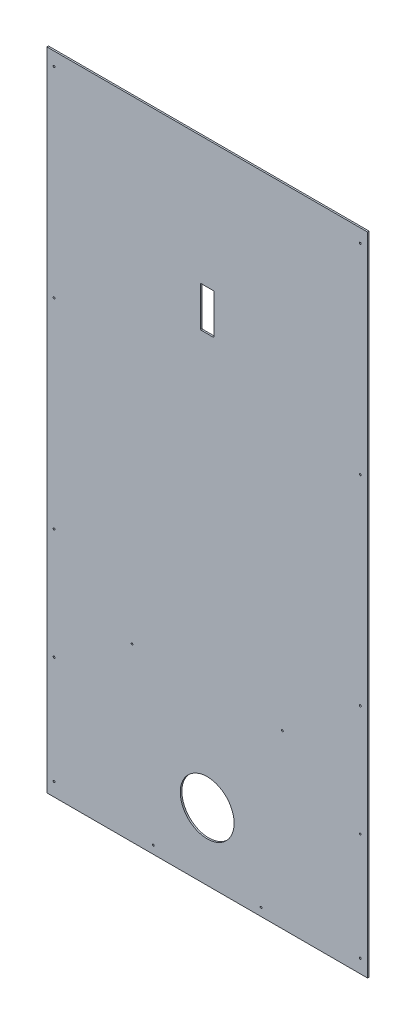
ISO-10303-21;
HEADER;
FILE_DESCRIPTION(('STEP AP214'),'2;1');
FILE_NAME('part.step','',(''),(''),'','','');
FILE_SCHEMA(('AUTOMOTIVE_DESIGN { 1 0 10303 214 1 1 1 1 }'));
ENDSEC;
DATA;
#1=APPLICATION_CONTEXT('core data for automotive mechanical design processes');
#2=APPLICATION_PROTOCOL_DEFINITION('international standard','automotive_design',2000,#1);
#3=PRODUCT_CONTEXT('',#1,'mechanical');
#4=PRODUCT('Part','Part','',(#3));
#5=PRODUCT_RELATED_PRODUCT_CATEGORY('part','',(#4));
#6=PRODUCT_DEFINITION_FORMATION('','',#4);
#7=PRODUCT_DEFINITION_CONTEXT('part definition',#1,'design');
#8=PRODUCT_DEFINITION('design','',#6,#7);
#9=PRODUCT_DEFINITION_SHAPE('','',#8);
#10=(LENGTH_UNIT() NAMED_UNIT(*) SI_UNIT(.MILLI.,.METRE.));
#11=(NAMED_UNIT(*) PLANE_ANGLE_UNIT() SI_UNIT($,.RADIAN.));
#12=(NAMED_UNIT(*) SI_UNIT($,.STERADIAN.) SOLID_ANGLE_UNIT());
#13=UNCERTAINTY_MEASURE_WITH_UNIT(LENGTH_MEASURE(1.E-05),#10,'distance_accuracy_value','');
#14=(GEOMETRIC_REPRESENTATION_CONTEXT(3) GLOBAL_UNCERTAINTY_ASSIGNED_CONTEXT((#13)) GLOBAL_UNIT_ASSIGNED_CONTEXT((#10,
#11,#12)) REPRESENTATION_CONTEXT('',''));
#15=CARTESIAN_POINT('',(0.,0.,0.));
#16=DIRECTION('',(0.,0.,1.));
#17=DIRECTION('',(1.,0.,0.));
#18=AXIS2_PLACEMENT_3D('',#15,#16,#17);
#19=CARTESIAN_POINT('',(-302.41875,609.6,2.9972));
#20=DIRECTION('',(0.,-1.,0.));
#21=DIRECTION('',(0.,0.,-1.));
#22=AXIS2_PLACEMENT_3D('',#19,#20,#21);
#23=PLANE('',#22);
#24=DIRECTION('',(0.,0.,-1.));
#25=VECTOR('',#24,1.);
#26=CARTESIAN_POINT('',(302.41875,609.6,1.4986));
#27=LINE('',#26,#25);
#28=CARTESIAN_POINT('',(302.41875,609.6,2.9972));
#29=VERTEX_POINT('',#28);
#30=CARTESIAN_POINT('',(302.41875,609.6,0.));
#31=VERTEX_POINT('',#30);
#32=EDGE_CURVE('E132',#29,#31,#27,.T.);
#33=ORIENTED_EDGE('',*,*,#32,.T.);
#34=DIRECTION('',(-1.,0.,0.));
#35=VECTOR('',#34,1.);
#36=CARTESIAN_POINT('',(0.,609.6,0.));
#37=LINE('',#36,#35);
#38=CARTESIAN_POINT('',(-302.41875,609.6,0.));
#39=VERTEX_POINT('',#38);
#40=EDGE_CURVE('E126',#31,#39,#37,.T.);
#41=ORIENTED_EDGE('',*,*,#40,.T.);
#42=DIRECTION('',(0.,0.,1.));
#43=VECTOR('',#42,1.);
#44=CARTESIAN_POINT('',(-302.41875,609.6,1.4986));
#45=LINE('',#44,#43);
#46=CARTESIAN_POINT('',(-302.41875,609.6,2.9972));
#47=VERTEX_POINT('',#46);
#48=EDGE_CURVE('E111',#39,#47,#45,.T.);
#49=ORIENTED_EDGE('',*,*,#48,.T.);
#50=DIRECTION('',(-1.,0.,0.));
#51=VECTOR('',#50,1.);
#52=CARTESIAN_POINT('',(0.,609.6,2.9972));
#53=LINE('',#52,#51);
#54=EDGE_CURVE('E216',#29,#47,#53,.T.);
#55=ORIENTED_EDGE('',*,*,#54,.F.);
#56=EDGE_LOOP('',(#33,#41,#49,#55));
#57=FACE_BOUND('',#56,.T.);
#58=ADVANCED_FACE('F17',(#57),#23,.F.);
#59=CARTESIAN_POINT('',(-302.41875,-609.6,2.9972));
#60=DIRECTION('',(1.,0.,0.));
#61=DIRECTION('',(0.,0.,-1.));
#62=AXIS2_PLACEMENT_3D('',#59,#60,#61);
#63=PLANE('',#62);
#64=ORIENTED_EDGE('',*,*,#48,.F.);
#65=DIRECTION('',(0.,-1.,0.));
#66=VECTOR('',#65,1.);
#67=CARTESIAN_POINT('',(-302.41875,0.,0.));
#68=LINE('',#67,#66);
#69=CARTESIAN_POINT('',(-302.41875,-609.6,0.));
#70=VERTEX_POINT('',#69);
#71=EDGE_CURVE('E115',#39,#70,#68,.T.);
#72=ORIENTED_EDGE('',*,*,#71,.T.);
#73=DIRECTION('',(0.,0.,1.));
#74=VECTOR('',#73,1.);
#75=CARTESIAN_POINT('',(-302.41875,-609.6,1.4986));
#76=LINE('',#75,#74);
#77=CARTESIAN_POINT('',(-302.41875,-609.6,2.9972));
#78=VERTEX_POINT('',#77);
#79=EDGE_CURVE('E121',#70,#78,#76,.T.);
#80=ORIENTED_EDGE('',*,*,#79,.T.);
#81=DIRECTION('',(0.,-1.,0.));
#82=VECTOR('',#81,1.);
#83=CARTESIAN_POINT('',(-302.41875,0.,2.9972));
#84=LINE('',#83,#82);
#85=EDGE_CURVE('E117',#47,#78,#84,.T.);
#86=ORIENTED_EDGE('',*,*,#85,.F.);
#87=EDGE_LOOP('',(#64,#72,#80,#86));
#88=FACE_BOUND('',#87,.T.);
#89=ADVANCED_FACE('F113',(#88),#63,.F.);
#90=CARTESIAN_POINT('',(-302.41875,-609.6,0.));
#91=DIRECTION('',(0.,1.,0.));
#92=DIRECTION('',(0.,0.,1.));
#93=AXIS2_PLACEMENT_3D('',#90,#91,#92);
#94=PLANE('',#93);
#95=ORIENTED_EDGE('',*,*,#79,.F.);
#96=DIRECTION('',(1.,0.,0.));
#97=VECTOR('',#96,1.);
#98=CARTESIAN_POINT('',(0.,-609.6,0.));
#99=LINE('',#98,#97);
#100=CARTESIAN_POINT('',(302.41875,-609.6,0.));
#101=VERTEX_POINT('',#100);
#102=EDGE_CURVE('E129',#70,#101,#99,.T.);
#103=ORIENTED_EDGE('',*,*,#102,.T.);
#104=DIRECTION('',(0.,0.,1.));
#105=VECTOR('',#104,1.);
#106=CARTESIAN_POINT('',(302.41875,-609.6,1.4986));
#107=LINE('',#106,#105);
#108=CARTESIAN_POINT('',(302.41875,-609.6,2.9972));
#109=VERTEX_POINT('',#108);
#110=EDGE_CURVE('E95',#101,#109,#107,.T.);
#111=ORIENTED_EDGE('',*,*,#110,.T.);
#112=DIRECTION('',(1.,0.,0.));
#113=VECTOR('',#112,1.);
#114=CARTESIAN_POINT('',(0.,-609.6,2.9972));
#115=LINE('',#114,#113);
#116=EDGE_CURVE('E285',#78,#109,#115,.T.);
#117=ORIENTED_EDGE('',*,*,#116,.F.);
#118=EDGE_LOOP('',(#95,#103,#111,#117));
#119=FACE_BOUND('',#118,.T.);
#120=ADVANCED_FACE('F423',(#119),#94,.F.);
#121=CARTESIAN_POINT('',(302.41875,-609.6,0.));
#122=DIRECTION('',(-1.,0.,0.));
#123=DIRECTION('',(0.,0.,1.));
#124=AXIS2_PLACEMENT_3D('',#121,#122,#123);
#125=PLANE('',#124);
#126=ORIENTED_EDGE('',*,*,#110,.F.);
#127=DIRECTION('',(0.,1.,0.));
#128=VECTOR('',#127,1.);
#129=CARTESIAN_POINT('',(302.41875,0.,0.));
#130=LINE('',#129,#128);
#131=EDGE_CURVE('E269',#101,#31,#130,.T.);
#132=ORIENTED_EDGE('',*,*,#131,.T.);
#133=ORIENTED_EDGE('',*,*,#32,.F.);
#134=DIRECTION('',(0.,1.,0.));
#135=VECTOR('',#134,1.);
#136=CARTESIAN_POINT('',(302.41875,0.,2.9972));
#137=LINE('',#136,#135);
#138=EDGE_CURVE('E212',#109,#29,#137,.T.);
#139=ORIENTED_EDGE('',*,*,#138,.F.);
#140=EDGE_LOOP('',(#126,#132,#133,#139));
#141=FACE_BOUND('',#140,.T.);
#142=ADVANCED_FACE('F418',(#141),#125,.F.);
#143=CARTESIAN_POINT('',(288.925,-171.45,0.));
#144=DIRECTION('',(0.,0.,1.));
#145=DIRECTION('',(1.,0.,0.));
#146=AXIS2_PLACEMENT_3D('',#143,#144,#145);
#147=CYLINDRICAL_SURFACE('',#146,1.778);
#148=CARTESIAN_POINT('',(288.925,-171.45,0.));
#149=DIRECTION('',(0.,0.,1.));
#150=DIRECTION('',(1.,0.,0.));
#151=AXIS2_PLACEMENT_3D('',#148,#149,#150);
#152=CIRCLE('',#151,1.778);
#153=CARTESIAN_POINT('',(290.703,-171.45,0.));
#154=VERTEX_POINT('',#153);
#155=EDGE_CURVE('E21',#154,#154,#152,.F.);
#156=ORIENTED_EDGE('',*,*,#155,.T.);
#157=EDGE_LOOP('',(#156));
#158=FACE_BOUND('',#157,.T.);
#159=CARTESIAN_POINT('',(288.925,-171.45,2.9972));
#160=DIRECTION('',(0.,0.,1.));
#161=DIRECTION('',(1.,0.,0.));
#162=AXIS2_PLACEMENT_3D('',#159,#160,#161);
#163=CIRCLE('',#162,1.778);
#164=CARTESIAN_POINT('',(290.703,-171.45,2.9972));
#165=VERTEX_POINT('',#164);
#166=EDGE_CURVE('E209',#165,#165,#163,.F.);
#167=ORIENTED_EDGE('',*,*,#166,.F.);
#168=EDGE_LOOP('',(#167));
#169=FACE_BOUND('',#168,.T.);
#170=ADVANCED_FACE('F415',(#158,#169),#147,.F.);
#171=CARTESIAN_POINT('',(288.925,584.2,0.));
#172=DIRECTION('',(0.,0.,1.));
#173=DIRECTION('',(1.,0.,0.));
#174=AXIS2_PLACEMENT_3D('',#171,#172,#173);
#175=CYLINDRICAL_SURFACE('',#174,1.778);
#176=CARTESIAN_POINT('',(288.925,584.2,0.));
#177=DIRECTION('',(0.,0.,1.));
#178=DIRECTION('',(1.,0.,0.));
#179=AXIS2_PLACEMENT_3D('',#176,#177,#178);
#180=CIRCLE('',#179,1.778);
#181=CARTESIAN_POINT('',(290.703,584.2,0.));
#182=VERTEX_POINT('',#181);
#183=EDGE_CURVE('E264',#182,#182,#180,.F.);
#184=ORIENTED_EDGE('',*,*,#183,.T.);
#185=EDGE_LOOP('',(#184));
#186=FACE_BOUND('',#185,.T.);
#187=CARTESIAN_POINT('',(288.925,584.2,2.9972));
#188=DIRECTION('',(0.,0.,1.));
#189=DIRECTION('',(1.,0.,0.));
#190=AXIS2_PLACEMENT_3D('',#187,#188,#189);
#191=CIRCLE('',#190,1.778);
#192=CARTESIAN_POINT('',(290.703,584.2,2.9972));
#193=VERTEX_POINT('',#192);
#194=EDGE_CURVE('E206',#193,#193,#191,.F.);
#195=ORIENTED_EDGE('',*,*,#194,.F.);
#196=EDGE_LOOP('',(#195));
#197=FACE_BOUND('',#196,.T.);
#198=ADVANCED_FACE('F411',(#186,#197),#175,.F.);
#199=CARTESIAN_POINT('',(-288.925,-584.2,0.));
#200=DIRECTION('',(0.,0.,1.));
#201=DIRECTION('',(1.,0.,0.));
#202=AXIS2_PLACEMENT_3D('',#199,#200,#201);
#203=CYLINDRICAL_SURFACE('',#202,1.77799999999995);
#204=CARTESIAN_POINT('',(-288.925,-584.2,0.));
#205=DIRECTION('',(0.,0.,1.));
#206=DIRECTION('',(1.,0.,0.));
#207=AXIS2_PLACEMENT_3D('',#204,#205,#206);
#208=CIRCLE('',#207,1.77799999999995);
#209=CARTESIAN_POINT('',(-287.147,-584.2,0.));
#210=VERTEX_POINT('',#209);
#211=EDGE_CURVE('E262',#210,#210,#208,.F.);
#212=ORIENTED_EDGE('',*,*,#211,.T.);
#213=EDGE_LOOP('',(#212));
#214=FACE_BOUND('',#213,.T.);
#215=CARTESIAN_POINT('',(-288.925,-584.2,2.9972));
#216=DIRECTION('',(0.,0.,1.));
#217=DIRECTION('',(1.,0.,0.));
#218=AXIS2_PLACEMENT_3D('',#215,#216,#217);
#219=CIRCLE('',#218,1.77799999999995);
#220=CARTESIAN_POINT('',(-287.147,-584.2,2.9972));
#221=VERTEX_POINT('',#220);
#222=EDGE_CURVE('E203',#221,#221,#219,.F.);
#223=ORIENTED_EDGE('',*,*,#222,.F.);
#224=EDGE_LOOP('',(#223));
#225=FACE_BOUND('',#224,.T.);
#226=ADVANCED_FACE('F407',(#214,#225),#203,.F.);
#227=CARTESIAN_POINT('',(-288.925,-381.,0.));
#228=DIRECTION('',(0.,0.,1.));
#229=DIRECTION('',(1.,0.,0.));
#230=AXIS2_PLACEMENT_3D('',#227,#228,#229);
#231=CYLINDRICAL_SURFACE('',#230,1.77799999999995);
#232=CARTESIAN_POINT('',(-288.925,-381.,0.));
#233=DIRECTION('',(0.,0.,1.));
#234=DIRECTION('',(1.,0.,0.));
#235=AXIS2_PLACEMENT_3D('',#232,#233,#234);
#236=CIRCLE('',#235,1.77799999999995);
#237=CARTESIAN_POINT('',(-287.147,-381.,0.));
#238=VERTEX_POINT('',#237);
#239=EDGE_CURVE('E259',#238,#238,#236,.F.);
#240=ORIENTED_EDGE('',*,*,#239,.T.);
#241=EDGE_LOOP('',(#240));
#242=FACE_BOUND('',#241,.T.);
#243=CARTESIAN_POINT('',(-288.925,-381.,2.9972));
#244=DIRECTION('',(0.,0.,1.));
#245=DIRECTION('',(1.,0.,0.));
#246=AXIS2_PLACEMENT_3D('',#243,#244,#245);
#247=CIRCLE('',#246,1.77799999999995);
#248=CARTESIAN_POINT('',(-287.147,-381.,2.9972));
#249=VERTEX_POINT('',#248);
#250=EDGE_CURVE('E200',#249,#249,#247,.F.);
#251=ORIENTED_EDGE('',*,*,#250,.F.);
#252=EDGE_LOOP('',(#251));
#253=FACE_BOUND('',#252,.T.);
#254=ADVANCED_FACE('F403',(#242,#253),#231,.F.);
#255=CARTESIAN_POINT('',(-288.925,-171.45,0.));
#256=DIRECTION('',(0.,0.,1.));
#257=DIRECTION('',(1.,0.,0.));
#258=AXIS2_PLACEMENT_3D('',#255,#256,#257);
#259=CYLINDRICAL_SURFACE('',#258,1.77799999999995);
#260=CARTESIAN_POINT('',(-288.925,-171.45,0.));
#261=DIRECTION('',(0.,0.,1.));
#262=DIRECTION('',(1.,0.,0.));
#263=AXIS2_PLACEMENT_3D('',#260,#261,#262);
#264=CIRCLE('',#263,1.77799999999995);
#265=CARTESIAN_POINT('',(-287.147,-171.45,0.));
#266=VERTEX_POINT('',#265);
#267=EDGE_CURVE('E256',#266,#266,#264,.F.);
#268=ORIENTED_EDGE('',*,*,#267,.T.);
#269=EDGE_LOOP('',(#268));
#270=FACE_BOUND('',#269,.T.);
#271=CARTESIAN_POINT('',(-288.925,-171.45,2.9972));
#272=DIRECTION('',(0.,0.,1.));
#273=DIRECTION('',(1.,0.,0.));
#274=AXIS2_PLACEMENT_3D('',#271,#272,#273);
#275=CIRCLE('',#274,1.77799999999995);
#276=CARTESIAN_POINT('',(-287.147,-171.45,2.9972));
#277=VERTEX_POINT('',#276);
#278=EDGE_CURVE('E197',#277,#277,#275,.F.);
#279=ORIENTED_EDGE('',*,*,#278,.F.);
#280=EDGE_LOOP('',(#279));
#281=FACE_BOUND('',#280,.T.);
#282=ADVANCED_FACE('F399',(#270,#281),#259,.F.);
#283=CARTESIAN_POINT('',(-288.925,206.375,0.));
#284=DIRECTION('',(0.,0.,1.));
#285=DIRECTION('',(1.,0.,0.));
#286=AXIS2_PLACEMENT_3D('',#283,#284,#285);
#287=CYLINDRICAL_SURFACE('',#286,1.77799999999995);
#288=CARTESIAN_POINT('',(-288.925,206.375,0.));
#289=DIRECTION('',(0.,0.,1.));
#290=DIRECTION('',(1.,0.,0.));
#291=AXIS2_PLACEMENT_3D('',#288,#289,#290);
#292=CIRCLE('',#291,1.77799999999995);
#293=CARTESIAN_POINT('',(-287.147,206.375,0.));
#294=VERTEX_POINT('',#293);
#295=EDGE_CURVE('E253',#294,#294,#292,.F.);
#296=ORIENTED_EDGE('',*,*,#295,.T.);
#297=EDGE_LOOP('',(#296));
#298=FACE_BOUND('',#297,.T.);
#299=CARTESIAN_POINT('',(-288.925,206.375,2.9972));
#300=DIRECTION('',(0.,0.,1.));
#301=DIRECTION('',(1.,0.,0.));
#302=AXIS2_PLACEMENT_3D('',#299,#300,#301);
#303=CIRCLE('',#302,1.77799999999995);
#304=CARTESIAN_POINT('',(-287.147,206.375,2.9972));
#305=VERTEX_POINT('',#304);
#306=EDGE_CURVE('E194',#305,#305,#303,.F.);
#307=ORIENTED_EDGE('',*,*,#306,.F.);
#308=EDGE_LOOP('',(#307));
#309=FACE_BOUND('',#308,.T.);
#310=ADVANCED_FACE('F395',(#298,#309),#287,.F.);
#311=CARTESIAN_POINT('',(-288.925,584.2,0.));
#312=DIRECTION('',(0.,0.,1.));
#313=DIRECTION('',(1.,0.,0.));
#314=AXIS2_PLACEMENT_3D('',#311,#312,#313);
#315=CYLINDRICAL_SURFACE('',#314,1.77799999999995);
#316=CARTESIAN_POINT('',(-288.925,584.2,0.));
#317=DIRECTION('',(0.,0.,1.));
#318=DIRECTION('',(1.,0.,0.));
#319=AXIS2_PLACEMENT_3D('',#316,#317,#318);
#320=CIRCLE('',#319,1.77799999999995);
#321=CARTESIAN_POINT('',(-287.147,584.2,0.));
#322=VERTEX_POINT('',#321);
#323=EDGE_CURVE('E250',#322,#322,#320,.F.);
#324=ORIENTED_EDGE('',*,*,#323,.T.);
#325=EDGE_LOOP('',(#324));
#326=FACE_BOUND('',#325,.T.);
#327=CARTESIAN_POINT('',(-288.925,584.2,2.9972));
#328=DIRECTION('',(0.,0.,1.));
#329=DIRECTION('',(1.,0.,0.));
#330=AXIS2_PLACEMENT_3D('',#327,#328,#329);
#331=CIRCLE('',#330,1.77799999999995);
#332=CARTESIAN_POINT('',(-287.147,584.2,2.9972));
#333=VERTEX_POINT('',#332);
#334=EDGE_CURVE('E191',#333,#333,#331,.F.);
#335=ORIENTED_EDGE('',*,*,#334,.F.);
#336=EDGE_LOOP('',(#335));
#337=FACE_BOUND('',#336,.T.);
#338=ADVANCED_FACE('F391',(#326,#337),#315,.F.);
#339=CARTESIAN_POINT('',(288.925,206.375,0.));
#340=DIRECTION('',(0.,0.,1.));
#341=DIRECTION('',(1.,0.,0.));
#342=AXIS2_PLACEMENT_3D('',#339,#340,#341);
#343=CYLINDRICAL_SURFACE('',#342,1.778);
#344=CARTESIAN_POINT('',(288.925,206.375,0.));
#345=DIRECTION('',(0.,0.,1.));
#346=DIRECTION('',(1.,0.,0.));
#347=AXIS2_PLACEMENT_3D('',#344,#345,#346);
#348=CIRCLE('',#347,1.778);
#349=CARTESIAN_POINT('',(290.703,206.375,0.));
#350=VERTEX_POINT('',#349);
#351=EDGE_CURVE('E247',#350,#350,#348,.F.);
#352=ORIENTED_EDGE('',*,*,#351,.T.);
#353=EDGE_LOOP('',(#352));
#354=FACE_BOUND('',#353,.T.);
#355=CARTESIAN_POINT('',(288.925,206.375,2.9972));
#356=DIRECTION('',(0.,0.,1.));
#357=DIRECTION('',(1.,0.,0.));
#358=AXIS2_PLACEMENT_3D('',#355,#356,#357);
#359=CIRCLE('',#358,1.778);
#360=CARTESIAN_POINT('',(290.703,206.375,2.9972));
#361=VERTEX_POINT('',#360);
#362=EDGE_CURVE('E188',#361,#361,#359,.F.);
#363=ORIENTED_EDGE('',*,*,#362,.F.);
#364=EDGE_LOOP('',(#363));
#365=FACE_BOUND('',#364,.T.);
#366=ADVANCED_FACE('F387',(#354,#365),#343,.F.);
#367=CARTESIAN_POINT('',(288.925,-381.,0.));
#368=DIRECTION('',(0.,0.,1.));
#369=DIRECTION('',(1.,0.,0.));
#370=AXIS2_PLACEMENT_3D('',#367,#368,#369);
#371=CYLINDRICAL_SURFACE('',#370,1.778);
#372=CARTESIAN_POINT('',(288.925,-381.,0.));
#373=DIRECTION('',(0.,0.,1.));
#374=DIRECTION('',(1.,0.,0.));
#375=AXIS2_PLACEMENT_3D('',#372,#373,#374);
#376=CIRCLE('',#375,1.778);
#377=CARTESIAN_POINT('',(290.703,-381.,0.));
#378=VERTEX_POINT('',#377);
#379=EDGE_CURVE('E244',#378,#378,#376,.F.);
#380=ORIENTED_EDGE('',*,*,#379,.T.);
#381=EDGE_LOOP('',(#380));
#382=FACE_BOUND('',#381,.T.);
#383=CARTESIAN_POINT('',(288.925,-381.,2.9972));
#384=DIRECTION('',(0.,0.,1.));
#385=DIRECTION('',(1.,0.,0.));
#386=AXIS2_PLACEMENT_3D('',#383,#384,#385);
#387=CIRCLE('',#386,1.778);
#388=CARTESIAN_POINT('',(290.703,-381.,2.9972));
#389=VERTEX_POINT('',#388);
#390=EDGE_CURVE('E185',#389,#389,#387,.F.);
#391=ORIENTED_EDGE('',*,*,#390,.F.);
#392=EDGE_LOOP('',(#391));
#393=FACE_BOUND('',#392,.T.);
#394=ADVANCED_FACE('F384',(#382,#393),#371,.F.);
#395=CARTESIAN_POINT('',(11.1125,366.7125,2.9972));
#396=DIRECTION('',(0.,0.,-1.));
#397=DIRECTION('',(-1.,0.,0.));
#398=AXIS2_PLACEMENT_3D('',#395,#396,#397);
#399=CYLINDRICAL_SURFACE('',#398,1.5875);
#400=CARTESIAN_POINT('',(11.1125,366.7125,0.));
#401=DIRECTION('',(0.,0.,-1.));
#402=DIRECTION('',(-1.,0.,0.));
#403=AXIS2_PLACEMENT_3D('',#400,#401,#402);
#404=CIRCLE('',#403,1.5875);
#405=CARTESIAN_POINT('',(11.1125,368.2999997968,0.));
#406=VERTEX_POINT('',#405);
#407=CARTESIAN_POINT('',(12.6999999007813,366.7125,0.));
#408=VERTEX_POINT('',#407);
#409=EDGE_CURVE('E234',#406,#408,#404,.T.);
#410=ORIENTED_EDGE('',*,*,#409,.T.);
#411=DIRECTION('',(0.,0.,1.));
#412=VECTOR('',#411,1.);
#413=CARTESIAN_POINT('',(12.7,366.7125,1.4986));
#414=LINE('',#413,#412);
#415=CARTESIAN_POINT('',(12.6999999007813,366.7125,2.9972));
#416=VERTEX_POINT('',#415);
#417=EDGE_CURVE('E151',#408,#416,#414,.T.);
#418=ORIENTED_EDGE('',*,*,#417,.T.);
#419=CARTESIAN_POINT('',(11.1125,366.7125,2.9972));
#420=DIRECTION('',(0.,0.,-1.));
#421=DIRECTION('',(-1.,0.,0.));
#422=AXIS2_PLACEMENT_3D('',#419,#420,#421);
#423=CIRCLE('',#422,1.5875);
#424=CARTESIAN_POINT('',(11.1125,368.2999997968,2.9972));
#425=VERTEX_POINT('',#424);
#426=EDGE_CURVE('E183',#425,#416,#423,.T.);
#427=ORIENTED_EDGE('',*,*,#426,.F.);
#428=DIRECTION('',(0.,0.,-1.));
#429=VECTOR('',#428,1.);
#430=CARTESIAN_POINT('',(11.1125,368.3,1.4986));
#431=LINE('',#430,#429);
#432=EDGE_CURVE('E135',#425,#406,#431,.T.);
#433=ORIENTED_EDGE('',*,*,#432,.T.);
#434=EDGE_LOOP('',(#410,#418,#427,#433));
#435=FACE_BOUND('',#434,.T.);
#436=ADVANCED_FACE('F298',(#435),#399,.F.);
#437=CARTESIAN_POINT('',(12.7,293.6875,0.));
#438=DIRECTION('',(1.,0.,0.));
#439=DIRECTION('',(0.,1.,0.));
#440=AXIS2_PLACEMENT_3D('',#437,#438,#439);
#441=PLANE('',#440);
#442=DIRECTION('',(0.,0.,1.));
#443=VECTOR('',#442,1.);
#444=CARTESIAN_POINT('',(12.7,293.687499999349,1.4986));
#445=LINE('',#444,#443);
#446=CARTESIAN_POINT('',(12.6999999007813,293.687499999674,2.9972));
#447=VERTEX_POINT('',#446);
#448=CARTESIAN_POINT('',(12.6999999007813,293.687499999674,0.));
#449=VERTEX_POINT('',#448);
#450=EDGE_CURVE('E149',#447,#449,#445,.F.);
#451=ORIENTED_EDGE('',*,*,#450,.F.);
#452=DIRECTION('',(0.,-1.,0.));
#453=VECTOR('',#452,1.);
#454=CARTESIAN_POINT('',(12.6999998015625,0.,2.9972));
#455=LINE('',#454,#453);
#456=EDGE_CURVE('E182',#416,#447,#455,.T.);
#457=ORIENTED_EDGE('',*,*,#456,.F.);
#458=ORIENTED_EDGE('',*,*,#417,.F.);
#459=DIRECTION('',(0.,-1.,0.));
#460=VECTOR('',#459,1.);
#461=CARTESIAN_POINT('',(12.6999998015625,0.,0.));
#462=LINE('',#461,#460);
#463=EDGE_CURVE('E233',#408,#449,#462,.T.);
#464=ORIENTED_EDGE('',*,*,#463,.T.);
#465=EDGE_LOOP('',(#451,#457,#458,#464));
#466=FACE_BOUND('',#465,.T.);
#467=ADVANCED_FACE('F304',(#466),#441,.F.);
#468=CARTESIAN_POINT('',(11.1125,293.6875,2.9972));
#469=DIRECTION('',(0.,0.,-1.));
#470=DIRECTION('',(-1.,0.,0.));
#471=AXIS2_PLACEMENT_3D('',#468,#469,#470);
#472=CYLINDRICAL_SURFACE('',#471,1.5875);
#473=CARTESIAN_POINT('',(11.1125,293.6875,0.));
#474=DIRECTION('',(0.,0.,-1.));
#475=DIRECTION('',(-1.,0.,0.));
#476=AXIS2_PLACEMENT_3D('',#473,#474,#475);
#477=CIRCLE('',#476,1.5875);
#478=CARTESIAN_POINT('',(11.1125,292.0999997968,0.));
#479=VERTEX_POINT('',#478);
#480=EDGE_CURVE('E230',#449,#479,#477,.T.);
#481=ORIENTED_EDGE('',*,*,#480,.T.);
#482=DIRECTION('',(0.,0.,1.));
#483=VECTOR('',#482,1.);
#484=CARTESIAN_POINT('',(11.1125,292.1,1.4986));
#485=LINE('',#484,#483);
#486=CARTESIAN_POINT('',(11.1125,292.0999997968,2.9972));
#487=VERTEX_POINT('',#486);
#488=EDGE_CURVE('E146',#479,#487,#485,.T.);
#489=ORIENTED_EDGE('',*,*,#488,.T.);
#490=CARTESIAN_POINT('',(11.1125,293.6875,2.9972));
#491=DIRECTION('',(0.,0.,-1.));
#492=DIRECTION('',(-1.,0.,0.));
#493=AXIS2_PLACEMENT_3D('',#490,#491,#492);
#494=CIRCLE('',#493,1.5875);
#495=EDGE_CURVE('E180',#447,#487,#494,.T.);
#496=ORIENTED_EDGE('',*,*,#495,.F.);
#497=ORIENTED_EDGE('',*,*,#450,.T.);
#498=EDGE_LOOP('',(#481,#489,#496,#497));
#499=FACE_BOUND('',#498,.T.);
#500=ADVANCED_FACE('F308',(#499),#472,.F.);
#501=CARTESIAN_POINT('',(-11.1125,292.1,2.9972));
#502=DIRECTION('',(0.,-1.,0.));
#503=DIRECTION('',(0.,0.,-1.));
#504=AXIS2_PLACEMENT_3D('',#501,#502,#503);
#505=PLANE('',#504);
#506=ORIENTED_EDGE('',*,*,#488,.F.);
#507=DIRECTION('',(-1.,0.,0.));
#508=VECTOR('',#507,1.);
#509=CARTESIAN_POINT('',(0.,292.0999995936,0.));
#510=LINE('',#509,#508);
#511=CARTESIAN_POINT('',(-11.1124999996947,292.0999997968,0.));
#512=VERTEX_POINT('',#511);
#513=EDGE_CURVE('E229',#479,#512,#510,.T.);
#514=ORIENTED_EDGE('',*,*,#513,.T.);
#515=DIRECTION('',(0.,0.,1.));
#516=VECTOR('',#515,1.);
#517=CARTESIAN_POINT('',(-11.1124999993893,292.1,1.4986));
#518=LINE('',#517,#516);
#519=CARTESIAN_POINT('',(-11.1124999996947,292.0999997968,2.9972));
#520=VERTEX_POINT('',#519);
#521=EDGE_CURVE('E85',#520,#512,#518,.F.);
#522=ORIENTED_EDGE('',*,*,#521,.F.);
#523=DIRECTION('',(-1.,0.,0.));
#524=VECTOR('',#523,1.);
#525=CARTESIAN_POINT('',(0.,292.0999995936,2.9972));
#526=LINE('',#525,#524);
#527=EDGE_CURVE('E179',#487,#520,#526,.T.);
#528=ORIENTED_EDGE('',*,*,#527,.F.);
#529=EDGE_LOOP('',(#506,#514,#522,#528));
#530=FACE_BOUND('',#529,.T.);
#531=ADVANCED_FACE('F312',(#530),#505,.F.);
#532=CARTESIAN_POINT('',(-11.1125,293.6875,2.9972));
#533=DIRECTION('',(0.,0.,-1.));
#534=DIRECTION('',(-1.,0.,0.));
#535=AXIS2_PLACEMENT_3D('',#532,#533,#534);
#536=CYLINDRICAL_SURFACE('',#535,1.5875);
#537=CARTESIAN_POINT('',(-11.1125,293.6875,0.));
#538=DIRECTION('',(0.,0.,-1.));
#539=DIRECTION('',(-1.,0.,0.));
#540=AXIS2_PLACEMENT_3D('',#537,#538,#539);
#541=CIRCLE('',#540,1.5875);
#542=CARTESIAN_POINT('',(-12.6999999007812,293.6875,0.));
#543=VERTEX_POINT('',#542);
#544=EDGE_CURVE('E242',#512,#543,#541,.T.);
#545=ORIENTED_EDGE('',*,*,#544,.T.);
#546=DIRECTION('',(0.,0.,1.));
#547=VECTOR('',#546,1.);
#548=CARTESIAN_POINT('',(-12.7,293.6875,1.4986));
#549=LINE('',#548,#547);
#550=CARTESIAN_POINT('',(-12.6999999007812,293.6875,2.9972));
#551=VERTEX_POINT('',#550);
#552=EDGE_CURVE('E142',#543,#551,#549,.T.);
#553=ORIENTED_EDGE('',*,*,#552,.T.);
#554=CARTESIAN_POINT('',(-11.1125,293.6875,2.9972));
#555=DIRECTION('',(0.,0.,-1.));
#556=DIRECTION('',(-1.,0.,0.));
#557=AXIS2_PLACEMENT_3D('',#554,#555,#556);
#558=CIRCLE('',#557,1.5875);
#559=EDGE_CURVE('E177',#520,#551,#558,.T.);
#560=ORIENTED_EDGE('',*,*,#559,.F.);
#561=ORIENTED_EDGE('',*,*,#521,.T.);
#562=EDGE_LOOP('',(#545,#553,#560,#561));
#563=FACE_BOUND('',#562,.T.);
#564=ADVANCED_FACE('F313',(#563),#536,.F.);
#565=CARTESIAN_POINT('',(-12.7,366.7125,0.));
#566=DIRECTION('',(-1.,0.,0.));
#567=DIRECTION('',(0.,-1.,0.));
#568=AXIS2_PLACEMENT_3D('',#565,#566,#567);
#569=PLANE('',#568);
#570=ORIENTED_EDGE('',*,*,#552,.F.);
#571=DIRECTION('',(0.,1.,0.));
#572=VECTOR('',#571,1.);
#573=CARTESIAN_POINT('',(-12.6999998015624,0.,0.));
#574=LINE('',#573,#572);
#575=CARTESIAN_POINT('',(-12.6999999007812,366.7125,0.));
#576=VERTEX_POINT('',#575);
#577=EDGE_CURVE('E241',#543,#576,#574,.T.);
#578=ORIENTED_EDGE('',*,*,#577,.T.);
#579=DIRECTION('',(0.,0.,1.));
#580=VECTOR('',#579,1.);
#581=CARTESIAN_POINT('',(-12.7,366.7125,1.4986));
#582=LINE('',#581,#580);
#583=CARTESIAN_POINT('',(-12.6999999007812,366.7125,2.9972));
#584=VERTEX_POINT('',#583);
#585=EDGE_CURVE('E140',#584,#576,#582,.F.);
#586=ORIENTED_EDGE('',*,*,#585,.F.);
#587=DIRECTION('',(0.,1.,0.));
#588=VECTOR('',#587,1.);
#589=CARTESIAN_POINT('',(-12.6999998015624,0.,2.9972));
#590=LINE('',#589,#588);
#591=EDGE_CURVE('E176',#551,#584,#590,.T.);
#592=ORIENTED_EDGE('',*,*,#591,.F.);
#593=EDGE_LOOP('',(#570,#578,#586,#592));
#594=FACE_BOUND('',#593,.T.);
#595=ADVANCED_FACE('F317',(#594),#569,.F.);
#596=CARTESIAN_POINT('',(-11.1125,366.7125,2.9972));
#597=DIRECTION('',(0.,0.,-1.));
#598=DIRECTION('',(-1.,0.,0.));
#599=AXIS2_PLACEMENT_3D('',#596,#597,#598);
#600=CYLINDRICAL_SURFACE('',#599,1.5875);
#601=CARTESIAN_POINT('',(-11.1125,366.7125,0.));
#602=DIRECTION('',(0.,0.,-1.));
#603=DIRECTION('',(-1.,0.,0.));
#604=AXIS2_PLACEMENT_3D('',#601,#602,#603);
#605=CIRCLE('',#604,1.5875);
#606=CARTESIAN_POINT('',(-11.1125,368.2999997968,0.));
#607=VERTEX_POINT('',#606);
#608=EDGE_CURVE('E238',#576,#607,#605,.T.);
#609=ORIENTED_EDGE('',*,*,#608,.T.);
#610=DIRECTION('',(0.,0.,1.));
#611=VECTOR('',#610,1.);
#612=CARTESIAN_POINT('',(-11.1125,368.3,1.4986));
#613=LINE('',#612,#611);
#614=CARTESIAN_POINT('',(-11.1125,368.2999997968,2.9972));
#615=VERTEX_POINT('',#614);
#616=EDGE_CURVE('E133',#607,#615,#613,.T.);
#617=ORIENTED_EDGE('',*,*,#616,.T.);
#618=CARTESIAN_POINT('',(-11.1125,366.7125,2.9972));
#619=DIRECTION('',(0.,0.,-1.));
#620=DIRECTION('',(-1.,0.,0.));
#621=AXIS2_PLACEMENT_3D('',#618,#619,#620);
#622=CIRCLE('',#621,1.5875);
#623=EDGE_CURVE('E36',#584,#615,#622,.T.);
#624=ORIENTED_EDGE('',*,*,#623,.F.);
#625=ORIENTED_EDGE('',*,*,#585,.T.);
#626=EDGE_LOOP('',(#609,#617,#624,#625));
#627=FACE_BOUND('',#626,.T.);
#628=ADVANCED_FACE('F321',(#627),#600,.F.);
#629=CARTESIAN_POINT('',(-11.1125,368.3,0.));
#630=DIRECTION('',(0.,1.,0.));
#631=DIRECTION('',(0.,0.,1.));
#632=AXIS2_PLACEMENT_3D('',#629,#630,#631);
#633=PLANE('',#632);
#634=ORIENTED_EDGE('',*,*,#616,.F.);
#635=DIRECTION('',(1.,0.,0.));
#636=VECTOR('',#635,1.);
#637=CARTESIAN_POINT('',(0.,368.2999995936,0.));
#638=LINE('',#637,#636);
#639=EDGE_CURVE('E237',#607,#406,#638,.T.);
#640=ORIENTED_EDGE('',*,*,#639,.T.);
#641=ORIENTED_EDGE('',*,*,#432,.F.);
#642=DIRECTION('',(1.,0.,0.));
#643=VECTOR('',#642,1.);
#644=CARTESIAN_POINT('',(0.,368.2999995936,2.9972));
#645=LINE('',#644,#643);
#646=EDGE_CURVE('E174',#615,#425,#645,.T.);
#647=ORIENTED_EDGE('',*,*,#646,.F.);
#648=EDGE_LOOP('',(#634,#640,#641,#647));
#649=FACE_BOUND('',#648,.T.);
#650=ADVANCED_FACE('F323',(#649),#633,.F.);
#651=CARTESIAN_POINT('',(141.907,-285.786228099,2.9972));
#652=DIRECTION('',(0.,0.,-1.));
#653=DIRECTION('',(-1.,0.,0.));
#654=AXIS2_PLACEMENT_3D('',#651,#652,#653);
#655=CYLINDRICAL_SURFACE('',#654,1.62559999999998);
#656=CARTESIAN_POINT('',(141.907,-285.786228099,0.));
#657=DIRECTION('',(0.,0.,-1.));
#658=DIRECTION('',(-1.,0.,0.));
#659=AXIS2_PLACEMENT_3D('',#656,#657,#658);
#660=CIRCLE('',#659,1.62559999999998);
#661=CARTESIAN_POINT('',(140.2814,-285.786228099,0.));
#662=VERTEX_POINT('',#661);
#663=EDGE_CURVE('E226',#662,#662,#660,.T.);
#664=ORIENTED_EDGE('',*,*,#663,.T.);
#665=EDGE_LOOP('',(#664));
#666=FACE_BOUND('',#665,.T.);
#667=CARTESIAN_POINT('',(141.907,-285.786228099,2.9972));
#668=DIRECTION('',(0.,0.,-1.));
#669=DIRECTION('',(-1.,0.,0.));
#670=AXIS2_PLACEMENT_3D('',#667,#668,#669);
#671=CIRCLE('',#670,1.62559999999998);
#672=CARTESIAN_POINT('',(140.2814,-285.786228099,2.9972));
#673=VERTEX_POINT('',#672);
#674=EDGE_CURVE('E171',#673,#673,#671,.T.);
#675=ORIENTED_EDGE('',*,*,#674,.F.);
#676=EDGE_LOOP('',(#675));
#677=FACE_BOUND('',#676,.T.);
#678=ADVANCED_FACE('F371',(#666,#677),#655,.F.);
#679=CARTESIAN_POINT('',(-141.907,-285.786228099,2.9972));
#680=DIRECTION('',(0.,0.,-1.));
#681=DIRECTION('',(-1.,0.,0.));
#682=AXIS2_PLACEMENT_3D('',#679,#680,#681);
#683=CYLINDRICAL_SURFACE('',#682,1.6256);
#684=CARTESIAN_POINT('',(-141.907,-285.786228099,0.));
#685=DIRECTION('',(0.,0.,-1.));
#686=DIRECTION('',(-1.,0.,0.));
#687=AXIS2_PLACEMENT_3D('',#684,#685,#686);
#688=CIRCLE('',#687,1.6256);
#689=CARTESIAN_POINT('',(-143.5326,-285.786228099,0.));
#690=VERTEX_POINT('',#689);
#691=EDGE_CURVE('E223',#690,#690,#688,.T.);
#692=ORIENTED_EDGE('',*,*,#691,.T.);
#693=EDGE_LOOP('',(#692));
#694=FACE_BOUND('',#693,.T.);
#695=CARTESIAN_POINT('',(-141.907,-285.786228099,2.9972));
#696=DIRECTION('',(0.,0.,-1.));
#697=DIRECTION('',(-1.,0.,0.));
#698=AXIS2_PLACEMENT_3D('',#695,#696,#697);
#699=CIRCLE('',#698,1.6256);
#700=CARTESIAN_POINT('',(-143.5326,-285.786228099,2.9972));
#701=VERTEX_POINT('',#700);
#702=EDGE_CURVE('E168',#701,#701,#699,.T.);
#703=ORIENTED_EDGE('',*,*,#702,.F.);
#704=EDGE_LOOP('',(#703));
#705=FACE_BOUND('',#704,.T.);
#706=ADVANCED_FACE('F367',(#694,#705),#683,.F.);
#707=CARTESIAN_POINT('',(-101.6,-594.614,0.));
#708=DIRECTION('',(0.,0.,1.));
#709=DIRECTION('',(1.,0.,0.));
#710=AXIS2_PLACEMENT_3D('',#707,#708,#709);
#711=CYLINDRICAL_SURFACE('',#710,1.62559999999999);
#712=CARTESIAN_POINT('',(-101.6,-594.614,0.));
#713=DIRECTION('',(0.,0.,1.));
#714=DIRECTION('',(1.,0.,0.));
#715=AXIS2_PLACEMENT_3D('',#712,#713,#714);
#716=CIRCLE('',#715,1.62559999999999);
#717=CARTESIAN_POINT('',(-99.9744,-594.614,0.));
#718=VERTEX_POINT('',#717);
#719=EDGE_CURVE('E220',#718,#718,#716,.F.);
#720=ORIENTED_EDGE('',*,*,#719,.T.);
#721=EDGE_LOOP('',(#720));
#722=FACE_BOUND('',#721,.T.);
#723=CARTESIAN_POINT('',(-101.6,-594.614,2.9972));
#724=DIRECTION('',(0.,0.,1.));
#725=DIRECTION('',(1.,0.,0.));
#726=AXIS2_PLACEMENT_3D('',#723,#724,#725);
#727=CIRCLE('',#726,1.62559999999999);
#728=CARTESIAN_POINT('',(-99.9744,-594.614,2.9972));
#729=VERTEX_POINT('',#728);
#730=EDGE_CURVE('E165',#729,#729,#727,.F.);
#731=ORIENTED_EDGE('',*,*,#730,.F.);
#732=EDGE_LOOP('',(#731));
#733=FACE_BOUND('',#732,.T.);
#734=ADVANCED_FACE('F363',(#722,#733),#711,.F.);
#735=CARTESIAN_POINT('',(101.6,-594.614,0.));
#736=DIRECTION('',(0.,0.,1.));
#737=DIRECTION('',(1.,0.,0.));
#738=AXIS2_PLACEMENT_3D('',#735,#736,#737);
#739=CYLINDRICAL_SURFACE('',#738,1.6256);
#740=CARTESIAN_POINT('',(101.6,-594.614,0.));
#741=DIRECTION('',(0.,0.,1.));
#742=DIRECTION('',(1.,0.,0.));
#743=AXIS2_PLACEMENT_3D('',#740,#741,#742);
#744=CIRCLE('',#743,1.6256);
#745=CARTESIAN_POINT('',(103.2256,-594.614,0.));
#746=VERTEX_POINT('',#745);
#747=EDGE_CURVE('E217',#746,#746,#744,.F.);
#748=ORIENTED_EDGE('',*,*,#747,.T.);
#749=EDGE_LOOP('',(#748));
#750=FACE_BOUND('',#749,.T.);
#751=CARTESIAN_POINT('',(101.6,-594.614,2.9972));
#752=DIRECTION('',(0.,0.,1.));
#753=DIRECTION('',(1.,0.,0.));
#754=AXIS2_PLACEMENT_3D('',#751,#752,#753);
#755=CIRCLE('',#754,1.6256);
#756=CARTESIAN_POINT('',(103.2256,-594.614,2.9972));
#757=VERTEX_POINT('',#756);
#758=EDGE_CURVE('E162',#757,#757,#755,.F.);
#759=ORIENTED_EDGE('',*,*,#758,.F.);
#760=EDGE_LOOP('',(#759));
#761=FACE_BOUND('',#760,.T.);
#762=ADVANCED_FACE('F359',(#750,#761),#739,.F.);
#763=CARTESIAN_POINT('',(0.,-482.6,0.));
#764=DIRECTION('',(0.,0.,1.));
#765=DIRECTION('',(1.,0.,0.));
#766=AXIS2_PLACEMENT_3D('',#763,#764,#765);
#767=CYLINDRICAL_SURFACE('',#766,50.8);
#768=CARTESIAN_POINT('',(0.,-482.6,0.));
#769=DIRECTION('',(0.,0.,1.));
#770=DIRECTION('',(1.,0.,0.));
#771=AXIS2_PLACEMENT_3D('',#768,#769,#770);
#772=CIRCLE('',#771,50.8);
#773=CARTESIAN_POINT('',(50.8,-482.6,0.));
#774=VERTEX_POINT('',#773);
#775=EDGE_CURVE('E213',#774,#774,#772,.F.);
#776=ORIENTED_EDGE('',*,*,#775,.T.);
#777=EDGE_LOOP('',(#776));
#778=FACE_BOUND('',#777,.T.);
#779=CARTESIAN_POINT('',(0.,-482.6,2.9972));
#780=DIRECTION('',(0.,0.,1.));
#781=DIRECTION('',(1.,0.,0.));
#782=AXIS2_PLACEMENT_3D('',#779,#780,#781);
#783=CIRCLE('',#782,50.8);
#784=CARTESIAN_POINT('',(50.8,-482.6,2.9972));
#785=VERTEX_POINT('',#784);
#786=EDGE_CURVE('E159',#785,#785,#783,.F.);
#787=ORIENTED_EDGE('',*,*,#786,.F.);
#788=EDGE_LOOP('',(#787));
#789=FACE_BOUND('',#788,.T.);
#790=ADVANCED_FACE('F327',(#778,#789),#767,.F.);
#791=CARTESIAN_POINT('',(-302.41875,-609.6,0.));
#792=DIRECTION('',(0.,0.,1.));
#793=DIRECTION('',(1.,0.,0.));
#794=AXIS2_PLACEMENT_3D('',#791,#792,#793);
#795=PLANE('',#794);
#796=ORIENTED_EDGE('',*,*,#775,.F.);
#797=EDGE_LOOP('',(#796));
#798=FACE_BOUND('',#797,.T.);
#799=ORIENTED_EDGE('',*,*,#747,.F.);
#800=EDGE_LOOP('',(#799));
#801=FACE_BOUND('',#800,.T.);
#802=ORIENTED_EDGE('',*,*,#719,.F.);
#803=EDGE_LOOP('',(#802));
#804=FACE_BOUND('',#803,.T.);
#805=ORIENTED_EDGE('',*,*,#691,.F.);
#806=EDGE_LOOP('',(#805));
#807=FACE_BOUND('',#806,.T.);
#808=ORIENTED_EDGE('',*,*,#663,.F.);
#809=EDGE_LOOP('',(#808));
#810=FACE_BOUND('',#809,.T.);
#811=ORIENTED_EDGE('',*,*,#480,.F.);
#812=ORIENTED_EDGE('',*,*,#463,.F.);
#813=ORIENTED_EDGE('',*,*,#409,.F.);
#814=ORIENTED_EDGE('',*,*,#639,.F.);
#815=ORIENTED_EDGE('',*,*,#608,.F.);
#816=ORIENTED_EDGE('',*,*,#577,.F.);
#817=ORIENTED_EDGE('',*,*,#544,.F.);
#818=ORIENTED_EDGE('',*,*,#513,.F.);
#819=EDGE_LOOP('',(#811,#812,#813,#814,#815,#816,#817,#818));
#820=FACE_BOUND('',#819,.T.);
#821=ORIENTED_EDGE('',*,*,#379,.F.);
#822=EDGE_LOOP('',(#821));
#823=FACE_BOUND('',#822,.T.);
#824=ORIENTED_EDGE('',*,*,#351,.F.);
#825=EDGE_LOOP('',(#824));
#826=FACE_BOUND('',#825,.T.);
#827=ORIENTED_EDGE('',*,*,#323,.F.);
#828=EDGE_LOOP('',(#827));
#829=FACE_BOUND('',#828,.T.);
#830=ORIENTED_EDGE('',*,*,#295,.F.);
#831=EDGE_LOOP('',(#830));
#832=FACE_BOUND('',#831,.T.);
#833=ORIENTED_EDGE('',*,*,#267,.F.);
#834=EDGE_LOOP('',(#833));
#835=FACE_BOUND('',#834,.T.);
#836=ORIENTED_EDGE('',*,*,#239,.F.);
#837=EDGE_LOOP('',(#836));
#838=FACE_BOUND('',#837,.T.);
#839=ORIENTED_EDGE('',*,*,#211,.F.);
#840=EDGE_LOOP('',(#839));
#841=FACE_BOUND('',#840,.T.);
#842=ORIENTED_EDGE('',*,*,#183,.F.);
#843=EDGE_LOOP('',(#842));
#844=FACE_BOUND('',#843,.T.);
#845=ORIENTED_EDGE('',*,*,#155,.F.);
#846=EDGE_LOOP('',(#845));
#847=FACE_BOUND('',#846,.T.);
#848=CARTESIAN_POINT('',(288.925,-584.2,0.));
#849=DIRECTION('',(0.,0.,1.));
#850=DIRECTION('',(1.,0.,0.));
#851=AXIS2_PLACEMENT_3D('',#848,#849,#850);
#852=CIRCLE('',#851,1.778);
#853=CARTESIAN_POINT('',(290.703,-584.2,0.));
#854=VERTEX_POINT('',#853);
#855=EDGE_CURVE('E27',#854,#854,#852,.F.);
#856=ORIENTED_EDGE('',*,*,#855,.F.);
#857=EDGE_LOOP('',(#856));
#858=FACE_BOUND('',#857,.T.);
#859=ORIENTED_EDGE('',*,*,#102,.F.);
#860=ORIENTED_EDGE('',*,*,#71,.F.);
#861=ORIENTED_EDGE('',*,*,#40,.F.);
#862=ORIENTED_EDGE('',*,*,#131,.F.);
#863=EDGE_LOOP('',(#859,#860,#861,#862));
#864=FACE_BOUND('',#863,.T.);
#865=ADVANCED_FACE('F125',(#798,#801,#804,#807,#810,#820,#823,#826,#829,#832,#835,#838,#841,
#844,#847,#858,#864),#795,.F.);
#866=CARTESIAN_POINT('',(-302.41875,-609.6,2.9972));
#867=DIRECTION('',(0.,0.,1.));
#868=DIRECTION('',(1.,0.,0.));
#869=AXIS2_PLACEMENT_3D('',#866,#867,#868);
#870=PLANE('',#869);
#871=ORIENTED_EDGE('',*,*,#786,.T.);
#872=EDGE_LOOP('',(#871));
#873=FACE_BOUND('',#872,.T.);
#874=ORIENTED_EDGE('',*,*,#758,.T.);
#875=EDGE_LOOP('',(#874));
#876=FACE_BOUND('',#875,.T.);
#877=ORIENTED_EDGE('',*,*,#730,.T.);
#878=EDGE_LOOP('',(#877));
#879=FACE_BOUND('',#878,.T.);
#880=ORIENTED_EDGE('',*,*,#702,.T.);
#881=EDGE_LOOP('',(#880));
#882=FACE_BOUND('',#881,.T.);
#883=ORIENTED_EDGE('',*,*,#674,.T.);
#884=EDGE_LOOP('',(#883));
#885=FACE_BOUND('',#884,.T.);
#886=ORIENTED_EDGE('',*,*,#623,.T.);
#887=ORIENTED_EDGE('',*,*,#646,.T.);
#888=ORIENTED_EDGE('',*,*,#426,.T.);
#889=ORIENTED_EDGE('',*,*,#456,.T.);
#890=ORIENTED_EDGE('',*,*,#495,.T.);
#891=ORIENTED_EDGE('',*,*,#527,.T.);
#892=ORIENTED_EDGE('',*,*,#559,.T.);
#893=ORIENTED_EDGE('',*,*,#591,.T.);
#894=EDGE_LOOP('',(#886,#887,#888,#889,#890,#891,#892,#893));
#895=FACE_BOUND('',#894,.T.);
#896=ORIENTED_EDGE('',*,*,#390,.T.);
#897=EDGE_LOOP('',(#896));
#898=FACE_BOUND('',#897,.T.);
#899=ORIENTED_EDGE('',*,*,#362,.T.);
#900=EDGE_LOOP('',(#899));
#901=FACE_BOUND('',#900,.T.);
#902=ORIENTED_EDGE('',*,*,#334,.T.);
#903=EDGE_LOOP('',(#902));
#904=FACE_BOUND('',#903,.T.);
#905=ORIENTED_EDGE('',*,*,#306,.T.);
#906=EDGE_LOOP('',(#905));
#907=FACE_BOUND('',#906,.T.);
#908=ORIENTED_EDGE('',*,*,#278,.T.);
#909=EDGE_LOOP('',(#908));
#910=FACE_BOUND('',#909,.T.);
#911=ORIENTED_EDGE('',*,*,#250,.T.);
#912=EDGE_LOOP('',(#911));
#913=FACE_BOUND('',#912,.T.);
#914=ORIENTED_EDGE('',*,*,#222,.T.);
#915=EDGE_LOOP('',(#914));
#916=FACE_BOUND('',#915,.T.);
#917=ORIENTED_EDGE('',*,*,#194,.T.);
#918=EDGE_LOOP('',(#917));
#919=FACE_BOUND('',#918,.T.);
#920=ORIENTED_EDGE('',*,*,#166,.T.);
#921=EDGE_LOOP('',(#920));
#922=FACE_BOUND('',#921,.T.);
#923=CARTESIAN_POINT('',(288.925,-584.2,2.9972));
#924=DIRECTION('',(0.,0.,1.));
#925=DIRECTION('',(1.,0.,0.));
#926=AXIS2_PLACEMENT_3D('',#923,#924,#925);
#927=CIRCLE('',#926,1.778);
#928=CARTESIAN_POINT('',(290.703,-584.2,2.9972));
#929=VERTEX_POINT('',#928);
#930=EDGE_CURVE('E11',#929,#929,#927,.T.);
#931=ORIENTED_EDGE('',*,*,#930,.F.);
#932=EDGE_LOOP('',(#931));
#933=FACE_BOUND('',#932,.T.);
#934=ORIENTED_EDGE('',*,*,#116,.T.);
#935=ORIENTED_EDGE('',*,*,#138,.T.);
#936=ORIENTED_EDGE('',*,*,#54,.T.);
#937=ORIENTED_EDGE('',*,*,#85,.T.);
#938=EDGE_LOOP('',(#934,#935,#936,#937));
#939=FACE_BOUND('',#938,.T.);
#940=ADVANCED_FACE('F19',(#873,#876,#879,#882,#885,#895,#898,#901,#904,#907,#910,#913,#916,#919,
#922,#933,#939),#870,.T.);
#941=CARTESIAN_POINT('',(288.925,-584.2,0.));
#942=DIRECTION('',(0.,0.,1.));
#943=DIRECTION('',(1.,0.,0.));
#944=AXIS2_PLACEMENT_3D('',#941,#942,#943);
#945=CYLINDRICAL_SURFACE('',#944,1.778);
#946=ORIENTED_EDGE('',*,*,#930,.T.);
#947=EDGE_LOOP('',(#946));
#948=FACE_BOUND('',#947,.T.);
#949=ORIENTED_EDGE('',*,*,#855,.T.);
#950=EDGE_LOOP('',(#949));
#951=FACE_BOUND('',#950,.T.);
#952=ADVANCED_FACE('F347',(#948,#951),#945,.F.);
#953=CLOSED_SHELL('',(#58,#89,#120,#142,#170,#198,#226,#254,#282,#310,#338,#366,#394,#436,#467,
#500,#531,#564,#595,#628,#650,#678,#706,#734,#762,#790,#865,#940,#952));
#954=MANIFOLD_SOLID_BREP('B1',#953);
#955=ADVANCED_BREP_SHAPE_REPRESENTATION('',(#18,#954),#14);
#956=SHAPE_DEFINITION_REPRESENTATION(#9,#955);
ENDSEC;
END-ISO-10303-21;
